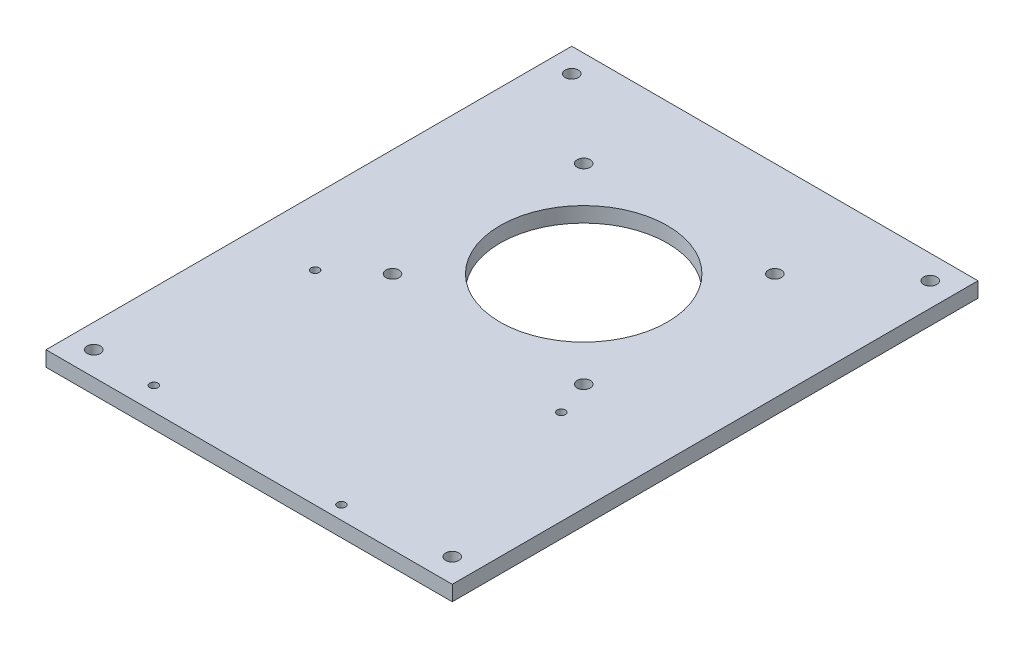
ISO-10303-21;
HEADER;
FILE_DESCRIPTION(('STEP AP214'),'2;1');
FILE_NAME('part.step','',(''),(''),'','','');
FILE_SCHEMA(('AUTOMOTIVE_DESIGN { 1 0 10303 214 1 1 1 1 }'));
ENDSEC;
DATA;
#1=APPLICATION_CONTEXT('core data for automotive mechanical design processes');
#2=APPLICATION_PROTOCOL_DEFINITION('international standard','automotive_design',2000,#1);
#3=PRODUCT_CONTEXT('',#1,'mechanical');
#4=PRODUCT('Part','Part','',(#3));
#5=PRODUCT_RELATED_PRODUCT_CATEGORY('part','',(#4));
#6=PRODUCT_DEFINITION_FORMATION('','',#4);
#7=PRODUCT_DEFINITION_CONTEXT('part definition',#1,'design');
#8=PRODUCT_DEFINITION('design','',#6,#7);
#9=PRODUCT_DEFINITION_SHAPE('','',#8);
#10=(LENGTH_UNIT() NAMED_UNIT(*) SI_UNIT(.MILLI.,.METRE.));
#11=(NAMED_UNIT(*) PLANE_ANGLE_UNIT() SI_UNIT($,.RADIAN.));
#12=(NAMED_UNIT(*) SI_UNIT($,.STERADIAN.) SOLID_ANGLE_UNIT());
#13=UNCERTAINTY_MEASURE_WITH_UNIT(LENGTH_MEASURE(1.E-05),#10,'distance_accuracy_value','');
#14=(GEOMETRIC_REPRESENTATION_CONTEXT(3) GLOBAL_UNCERTAINTY_ASSIGNED_CONTEXT((#13)) GLOBAL_UNIT_ASSIGNED_CONTEXT((#10,
#11,#12)) REPRESENTATION_CONTEXT('',''));
#15=CARTESIAN_POINT('',(0.,0.,0.));
#16=DIRECTION('',(0.,0.,1.));
#17=DIRECTION('',(1.,0.,0.));
#18=AXIS2_PLACEMENT_3D('',#15,#16,#17);
#19=CARTESIAN_POINT('',(0.,6.35,0.));
#20=DIRECTION('',(0.,1.,0.));
#21=DIRECTION('',(0.,0.,1.));
#22=AXIS2_PLACEMENT_3D('',#19,#20,#21);
#23=PLANE('',#22);
#24=CARTESIAN_POINT('',(-57.523089763629,6.34999999999999,54.859977456023));
#25=DIRECTION('',(0.,-1.,0.));
#26=DIRECTION('',(0.,0.,-1.));
#27=AXIS2_PLACEMENT_3D('',#24,#25,#26);
#28=CIRCLE('',#27,1.69999999999999);
#29=CARTESIAN_POINT('',(-57.523089763629,6.34999999999999,53.159977456023));
#30=VERTEX_POINT('',#29);
#31=EDGE_CURVE('E194',#30,#30,#28,.T.);
#32=ORIENTED_EDGE('',*,*,#31,.T.);
#33=EDGE_LOOP('',(#32));
#34=FACE_BOUND('',#33,.T.);
#35=CARTESIAN_POINT('',(45.476910236371,6.34999999999999,54.859977456023));
#36=DIRECTION('',(0.,-1.,0.));
#37=DIRECTION('',(0.,0.,-1.));
#38=AXIS2_PLACEMENT_3D('',#35,#36,#37);
#39=CIRCLE('',#38,1.69999999999999);
#40=CARTESIAN_POINT('',(45.476910236371,6.34999999999999,53.159977456023));
#41=VERTEX_POINT('',#40);
#42=EDGE_CURVE('E185',#41,#41,#39,.T.);
#43=ORIENTED_EDGE('',*,*,#42,.T.);
#44=EDGE_LOOP('',(#43));
#45=FACE_BOUND('',#44,.T.);
#46=CARTESIAN_POINT('',(32.976910236371,6.34999999999999,134.359977456023));
#47=DIRECTION('',(0.,-1.,0.));
#48=DIRECTION('',(0.,0.,-1.));
#49=AXIS2_PLACEMENT_3D('',#46,#47,#48);
#50=CIRCLE('',#49,1.69999999999999);
#51=CARTESIAN_POINT('',(32.976910236371,6.34999999999999,132.659977456023));
#52=VERTEX_POINT('',#51);
#53=EDGE_CURVE('E176',#52,#52,#50,.T.);
#54=ORIENTED_EDGE('',*,*,#53,.T.);
#55=EDGE_LOOP('',(#54));
#56=FACE_BOUND('',#55,.T.);
#57=CARTESIAN_POINT('',(-49.523089763629,6.34999999999999,130.359977456023));
#58=DIRECTION('',(0.,-1.,0.));
#59=DIRECTION('',(0.,0.,-1.));
#60=AXIS2_PLACEMENT_3D('',#57,#58,#59);
#61=CIRCLE('',#60,1.69999999999999);
#62=CARTESIAN_POINT('',(-49.523089763629,6.34999999999999,128.659977456023));
#63=VERTEX_POINT('',#62);
#64=EDGE_CURVE('E165',#63,#63,#61,.T.);
#65=ORIENTED_EDGE('',*,*,#64,.T.);
#66=EDGE_LOOP('',(#65));
#67=FACE_BOUND('',#66,.T.);
#68=CARTESIAN_POINT('',(75.,6.35,-70.));
#69=DIRECTION('',(0.,1.,0.));
#70=DIRECTION('',(0.,0.,-1.));
#71=AXIS2_PLACEMENT_3D('',#68,#69,#70);
#72=CIRCLE('',#71,2.75000000000001);
#73=CARTESIAN_POINT('',(75.,6.35,-72.75));
#74=VERTEX_POINT('',#73);
#75=EDGE_CURVE('E153',#74,#74,#72,.T.);
#76=ORIENTED_EDGE('',*,*,#75,.F.);
#77=EDGE_LOOP('',(#76));
#78=FACE_BOUND('',#77,.T.);
#79=CARTESIAN_POINT('',(-75.,6.35,-70.));
#80=DIRECTION('',(0.,1.,0.));
#81=DIRECTION('',(0.,0.,1.));
#82=AXIS2_PLACEMENT_3D('',#79,#80,#81);
#83=CIRCLE('',#82,2.75000000000001);
#84=CARTESIAN_POINT('',(-75.,6.35,-67.25));
#85=VERTEX_POINT('',#84);
#86=EDGE_CURVE('E141',#85,#85,#83,.T.);
#87=ORIENTED_EDGE('',*,*,#86,.F.);
#88=EDGE_LOOP('',(#87));
#89=FACE_BOUND('',#88,.T.);
#90=CARTESIAN_POINT('',(40.,6.35,40.));
#91=DIRECTION('',(0.,1.,0.));
#92=DIRECTION('',(0.,0.,1.));
#93=AXIS2_PLACEMENT_3D('',#90,#91,#92);
#94=CIRCLE('',#93,2.75000000000001);
#95=CARTESIAN_POINT('',(40.,6.35,42.75));
#96=VERTEX_POINT('',#95);
#97=EDGE_CURVE('E129',#96,#96,#94,.T.);
#98=ORIENTED_EDGE('',*,*,#97,.F.);
#99=EDGE_LOOP('',(#98));
#100=FACE_BOUND('',#99,.T.);
#101=CARTESIAN_POINT('',(-40.,6.35,-40.));
#102=DIRECTION('',(0.,1.,0.));
#103=DIRECTION('',(0.,0.,1.));
#104=AXIS2_PLACEMENT_3D('',#101,#102,#103);
#105=CIRCLE('',#104,2.75000000000001);
#106=CARTESIAN_POINT('',(-40.,6.35,-37.25));
#107=VERTEX_POINT('',#106);
#108=EDGE_CURVE('E117',#107,#107,#105,.T.);
#109=ORIENTED_EDGE('',*,*,#108,.F.);
#110=EDGE_LOOP('',(#109));
#111=FACE_BOUND('',#110,.T.);
#112=DIRECTION('',(0.,0.,1.));
#113=VECTOR('',#112,1.);
#114=CARTESIAN_POINT('',(-85.,6.35,-80.));
#115=LINE('',#114,#113);
#116=CARTESIAN_POINT('',(-85.,6.35,-80.));
#117=VERTEX_POINT('',#116);
#118=CARTESIAN_POINT('',(-85.,6.35,140.));
#119=VERTEX_POINT('',#118);
#120=EDGE_CURVE('E87',#117,#119,#115,.T.);
#121=ORIENTED_EDGE('',*,*,#120,.T.);
#122=DIRECTION('',(1.,0.,0.));
#123=VECTOR('',#122,1.);
#124=CARTESIAN_POINT('',(-85.,6.35,140.));
#125=LINE('',#124,#123);
#126=CARTESIAN_POINT('',(85.,6.35,140.));
#127=VERTEX_POINT('',#126);
#128=EDGE_CURVE('E82',#119,#127,#125,.T.);
#129=ORIENTED_EDGE('',*,*,#128,.T.);
#130=DIRECTION('',(0.,0.,-1.));
#131=VECTOR('',#130,1.);
#132=CARTESIAN_POINT('',(85.,6.35,-80.));
#133=LINE('',#132,#131);
#134=CARTESIAN_POINT('',(85.,6.35,-80.));
#135=VERTEX_POINT('',#134);
#136=EDGE_CURVE('E85',#127,#135,#133,.T.);
#137=ORIENTED_EDGE('',*,*,#136,.T.);
#138=DIRECTION('',(-1.,0.,0.));
#139=VECTOR('',#138,1.);
#140=CARTESIAN_POINT('',(-85.,6.35,-80.));
#141=LINE('',#140,#139);
#142=EDGE_CURVE('E52',#135,#117,#141,.T.);
#143=ORIENTED_EDGE('',*,*,#142,.T.);
#144=EDGE_LOOP('',(#121,#129,#137,#143));
#145=FACE_BOUND('',#144,.T.);
#146=CARTESIAN_POINT('',(0.,6.35,0.));
#147=DIRECTION('',(0.,1.,0.));
#148=DIRECTION('',(0.,0.,1.));
#149=AXIS2_PLACEMENT_3D('',#146,#147,#148);
#150=CIRCLE('',#149,35.);
#151=CARTESIAN_POINT('',(0.,6.35,35.));
#152=VERTEX_POINT('',#151);
#153=EDGE_CURVE('E102',#152,#152,#150,.T.);
#154=ORIENTED_EDGE('',*,*,#153,.F.);
#155=EDGE_LOOP('',(#154));
#156=FACE_BOUND('',#155,.T.);
#157=CARTESIAN_POINT('',(40.,6.35,-40.));
#158=DIRECTION('',(0.,1.,0.));
#159=DIRECTION('',(0.,0.,-1.));
#160=AXIS2_PLACEMENT_3D('',#157,#158,#159);
#161=CIRCLE('',#160,2.75000000000001);
#162=CARTESIAN_POINT('',(40.,6.35,-42.75));
#163=VERTEX_POINT('',#162);
#164=EDGE_CURVE('E123',#163,#163,#161,.T.);
#165=ORIENTED_EDGE('',*,*,#164,.F.);
#166=EDGE_LOOP('',(#165));
#167=FACE_BOUND('',#166,.T.);
#168=CARTESIAN_POINT('',(-40.,6.35,40.));
#169=DIRECTION('',(0.,1.,0.));
#170=DIRECTION('',(0.,0.,-1.));
#171=AXIS2_PLACEMENT_3D('',#168,#169,#170);
#172=CIRCLE('',#171,2.75000000000001);
#173=CARTESIAN_POINT('',(-40.,6.35,37.25));
#174=VERTEX_POINT('',#173);
#175=EDGE_CURVE('E135',#174,#174,#172,.T.);
#176=ORIENTED_EDGE('',*,*,#175,.F.);
#177=EDGE_LOOP('',(#176));
#178=FACE_BOUND('',#177,.T.);
#179=CARTESIAN_POINT('',(-75.,6.35,130.));
#180=DIRECTION('',(0.,1.,0.));
#181=DIRECTION('',(0.,0.,1.));
#182=AXIS2_PLACEMENT_3D('',#179,#180,#181);
#183=CIRCLE('',#182,2.75000000000001);
#184=CARTESIAN_POINT('',(-75.,6.35,132.75));
#185=VERTEX_POINT('',#184);
#186=EDGE_CURVE('E147',#185,#185,#183,.T.);
#187=ORIENTED_EDGE('',*,*,#186,.F.);
#188=EDGE_LOOP('',(#187));
#189=FACE_BOUND('',#188,.T.);
#190=CARTESIAN_POINT('',(75.0000000000001,6.35,130.));
#191=DIRECTION('',(0.,1.,0.));
#192=DIRECTION('',(0.,0.,-1.));
#193=AXIS2_PLACEMENT_3D('',#190,#191,#192);
#194=CIRCLE('',#193,2.75000000000001);
#195=CARTESIAN_POINT('',(75.0000000000001,6.35,127.25));
#196=VERTEX_POINT('',#195);
#197=EDGE_CURVE('E159',#196,#196,#194,.T.);
#198=ORIENTED_EDGE('',*,*,#197,.F.);
#199=EDGE_LOOP('',(#198));
#200=FACE_BOUND('',#199,.T.);
#201=ADVANCED_FACE('F35',(#34,#45,#56,#67,#78,#89,#100,#111,#145,#156,#167,#178,#189,#200),#23,.T.);
#202=CARTESIAN_POINT('',(0.,0.,0.));
#203=DIRECTION('',(0.,1.,0.));
#204=DIRECTION('',(0.,0.,1.));
#205=AXIS2_PLACEMENT_3D('',#202,#203,#204);
#206=PLANE('',#205);
#207=CARTESIAN_POINT('',(-57.523089763629,0.,54.859977456023));
#208=DIRECTION('',(0.,-1.,0.));
#209=DIRECTION('',(0.,0.,-1.));
#210=AXIS2_PLACEMENT_3D('',#207,#208,#209);
#211=CIRCLE('',#210,3.15);
#212=CARTESIAN_POINT('',(-57.523089763629,0.,51.709977456023));
#213=VERTEX_POINT('',#212);
#214=EDGE_CURVE('E200',#213,#213,#211,.T.);
#215=ORIENTED_EDGE('',*,*,#214,.F.);
#216=EDGE_LOOP('',(#215));
#217=FACE_BOUND('',#216,.T.);
#218=CARTESIAN_POINT('',(45.476910236371,0.,54.859977456023));
#219=DIRECTION('',(0.,-1.,0.));
#220=DIRECTION('',(0.,0.,-1.));
#221=AXIS2_PLACEMENT_3D('',#218,#219,#220);
#222=CIRCLE('',#221,3.15);
#223=CARTESIAN_POINT('',(45.476910236371,0.,51.709977456023));
#224=VERTEX_POINT('',#223);
#225=EDGE_CURVE('E191',#224,#224,#222,.T.);
#226=ORIENTED_EDGE('',*,*,#225,.F.);
#227=EDGE_LOOP('',(#226));
#228=FACE_BOUND('',#227,.T.);
#229=CARTESIAN_POINT('',(32.976910236371,0.,134.359977456023));
#230=DIRECTION('',(0.,-1.,0.));
#231=DIRECTION('',(0.,0.,-1.));
#232=AXIS2_PLACEMENT_3D('',#229,#230,#231);
#233=CIRCLE('',#232,3.15);
#234=CARTESIAN_POINT('',(32.976910236371,0.,131.209977456023));
#235=VERTEX_POINT('',#234);
#236=EDGE_CURVE('E182',#235,#235,#233,.T.);
#237=ORIENTED_EDGE('',*,*,#236,.F.);
#238=EDGE_LOOP('',(#237));
#239=FACE_BOUND('',#238,.T.);
#240=CARTESIAN_POINT('',(-49.523089763629,0.,130.359977456023));
#241=DIRECTION('',(0.,-1.,0.));
#242=DIRECTION('',(0.,0.,-1.));
#243=AXIS2_PLACEMENT_3D('',#240,#241,#242);
#244=CIRCLE('',#243,3.15);
#245=CARTESIAN_POINT('',(-49.523089763629,0.,127.209977456023));
#246=VERTEX_POINT('',#245);
#247=EDGE_CURVE('E173',#246,#246,#244,.T.);
#248=ORIENTED_EDGE('',*,*,#247,.F.);
#249=EDGE_LOOP('',(#248));
#250=FACE_BOUND('',#249,.T.);
#251=CARTESIAN_POINT('',(75.,0.,-70.));
#252=DIRECTION('',(0.,1.,0.));
#253=DIRECTION('',(0.,0.,-1.));
#254=AXIS2_PLACEMENT_3D('',#251,#252,#253);
#255=CIRCLE('',#254,2.75000000000001);
#256=CARTESIAN_POINT('',(75.,0.,-72.75));
#257=VERTEX_POINT('',#256);
#258=EDGE_CURVE('E156',#257,#257,#255,.T.);
#259=ORIENTED_EDGE('',*,*,#258,.T.);
#260=EDGE_LOOP('',(#259));
#261=FACE_BOUND('',#260,.T.);
#262=CARTESIAN_POINT('',(-75.,0.,-70.));
#263=DIRECTION('',(0.,1.,0.));
#264=DIRECTION('',(0.,0.,1.));
#265=AXIS2_PLACEMENT_3D('',#262,#263,#264);
#266=CIRCLE('',#265,2.75000000000001);
#267=CARTESIAN_POINT('',(-75.,0.,-67.25));
#268=VERTEX_POINT('',#267);
#269=EDGE_CURVE('E144',#268,#268,#266,.T.);
#270=ORIENTED_EDGE('',*,*,#269,.T.);
#271=EDGE_LOOP('',(#270));
#272=FACE_BOUND('',#271,.T.);
#273=CARTESIAN_POINT('',(40.,0.,40.));
#274=DIRECTION('',(0.,1.,0.));
#275=DIRECTION('',(0.,0.,1.));
#276=AXIS2_PLACEMENT_3D('',#273,#274,#275);
#277=CIRCLE('',#276,2.75000000000001);
#278=CARTESIAN_POINT('',(40.,0.,42.75));
#279=VERTEX_POINT('',#278);
#280=EDGE_CURVE('E132',#279,#279,#277,.T.);
#281=ORIENTED_EDGE('',*,*,#280,.T.);
#282=EDGE_LOOP('',(#281));
#283=FACE_BOUND('',#282,.T.);
#284=CARTESIAN_POINT('',(-40.,0.,-40.));
#285=DIRECTION('',(0.,1.,0.));
#286=DIRECTION('',(0.,0.,1.));
#287=AXIS2_PLACEMENT_3D('',#284,#285,#286);
#288=CIRCLE('',#287,2.75000000000001);
#289=CARTESIAN_POINT('',(-40.,0.,-37.25));
#290=VERTEX_POINT('',#289);
#291=EDGE_CURVE('E120',#290,#290,#288,.T.);
#292=ORIENTED_EDGE('',*,*,#291,.T.);
#293=EDGE_LOOP('',(#292));
#294=FACE_BOUND('',#293,.T.);
#295=DIRECTION('',(0.,0.,1.));
#296=VECTOR('',#295,1.);
#297=CARTESIAN_POINT('',(-85.,0.,-80.));
#298=LINE('',#297,#296);
#299=CARTESIAN_POINT('',(-85.,0.,-80.));
#300=VERTEX_POINT('',#299);
#301=CARTESIAN_POINT('',(-85.,0.,140.));
#302=VERTEX_POINT('',#301);
#303=EDGE_CURVE('E99',#300,#302,#298,.T.);
#304=ORIENTED_EDGE('',*,*,#303,.F.);
#305=DIRECTION('',(-1.,0.,0.));
#306=VECTOR('',#305,1.);
#307=CARTESIAN_POINT('',(-85.,0.,-80.));
#308=LINE('',#307,#306);
#309=CARTESIAN_POINT('',(85.,0.,-80.));
#310=VERTEX_POINT('',#309);
#311=EDGE_CURVE('E75',#310,#300,#308,.T.);
#312=ORIENTED_EDGE('',*,*,#311,.F.);
#313=DIRECTION('',(0.,0.,-1.));
#314=VECTOR('',#313,1.);
#315=CARTESIAN_POINT('',(85.,0.,-80.));
#316=LINE('',#315,#314);
#317=CARTESIAN_POINT('',(85.,0.,140.));
#318=VERTEX_POINT('',#317);
#319=EDGE_CURVE('E69',#318,#310,#316,.T.);
#320=ORIENTED_EDGE('',*,*,#319,.F.);
#321=DIRECTION('',(1.,0.,0.));
#322=VECTOR('',#321,1.);
#323=CARTESIAN_POINT('',(-85.,0.,140.));
#324=LINE('',#323,#322);
#325=EDGE_CURVE('E91',#302,#318,#324,.T.);
#326=ORIENTED_EDGE('',*,*,#325,.F.);
#327=EDGE_LOOP('',(#304,#312,#320,#326));
#328=FACE_BOUND('',#327,.T.);
#329=CARTESIAN_POINT('',(0.,0.,0.));
#330=DIRECTION('',(0.,1.,0.));
#331=DIRECTION('',(0.,0.,1.));
#332=AXIS2_PLACEMENT_3D('',#329,#330,#331);
#333=CIRCLE('',#332,35.);
#334=CARTESIAN_POINT('',(0.,0.,35.));
#335=VERTEX_POINT('',#334);
#336=EDGE_CURVE('E114',#335,#335,#333,.T.);
#337=ORIENTED_EDGE('',*,*,#336,.T.);
#338=EDGE_LOOP('',(#337));
#339=FACE_BOUND('',#338,.T.);
#340=CARTESIAN_POINT('',(40.,0.,-40.));
#341=DIRECTION('',(0.,1.,0.));
#342=DIRECTION('',(0.,0.,-1.));
#343=AXIS2_PLACEMENT_3D('',#340,#341,#342);
#344=CIRCLE('',#343,2.75000000000001);
#345=CARTESIAN_POINT('',(40.,0.,-42.75));
#346=VERTEX_POINT('',#345);
#347=EDGE_CURVE('E126',#346,#346,#344,.T.);
#348=ORIENTED_EDGE('',*,*,#347,.T.);
#349=EDGE_LOOP('',(#348));
#350=FACE_BOUND('',#349,.T.);
#351=CARTESIAN_POINT('',(-40.,0.,40.));
#352=DIRECTION('',(0.,1.,0.));
#353=DIRECTION('',(0.,0.,-1.));
#354=AXIS2_PLACEMENT_3D('',#351,#352,#353);
#355=CIRCLE('',#354,2.75000000000001);
#356=CARTESIAN_POINT('',(-40.,0.,37.25));
#357=VERTEX_POINT('',#356);
#358=EDGE_CURVE('E138',#357,#357,#355,.T.);
#359=ORIENTED_EDGE('',*,*,#358,.T.);
#360=EDGE_LOOP('',(#359));
#361=FACE_BOUND('',#360,.T.);
#362=CARTESIAN_POINT('',(-75.,0.,130.));
#363=DIRECTION('',(0.,1.,0.));
#364=DIRECTION('',(0.,0.,1.));
#365=AXIS2_PLACEMENT_3D('',#362,#363,#364);
#366=CIRCLE('',#365,2.75000000000001);
#367=CARTESIAN_POINT('',(-75.,0.,132.75));
#368=VERTEX_POINT('',#367);
#369=EDGE_CURVE('E150',#368,#368,#366,.T.);
#370=ORIENTED_EDGE('',*,*,#369,.T.);
#371=EDGE_LOOP('',(#370));
#372=FACE_BOUND('',#371,.T.);
#373=CARTESIAN_POINT('',(75.0000000000001,0.,130.));
#374=DIRECTION('',(0.,1.,0.));
#375=DIRECTION('',(0.,0.,-1.));
#376=AXIS2_PLACEMENT_3D('',#373,#374,#375);
#377=CIRCLE('',#376,2.75000000000001);
#378=CARTESIAN_POINT('',(75.0000000000001,0.,127.25));
#379=VERTEX_POINT('',#378);
#380=EDGE_CURVE('E162',#379,#379,#377,.T.);
#381=ORIENTED_EDGE('',*,*,#380,.T.);
#382=EDGE_LOOP('',(#381));
#383=FACE_BOUND('',#382,.T.);
#384=ADVANCED_FACE('F110',(#217,#228,#239,#250,#261,#272,#283,#294,#328,#339,#350,#361,#372,
#383),#206,.F.);
#385=CARTESIAN_POINT('',(-85.,6.35,-80.));
#386=DIRECTION('',(1.,0.,0.));
#387=DIRECTION('',(0.,0.,-1.));
#388=AXIS2_PLACEMENT_3D('',#385,#386,#387);
#389=PLANE('',#388);
#390=ORIENTED_EDGE('',*,*,#303,.T.);
#391=DIRECTION('',(0.,-1.,0.));
#392=VECTOR('',#391,1.);
#393=CARTESIAN_POINT('',(-85.,6.35,140.));
#394=LINE('',#393,#392);
#395=EDGE_CURVE('E11',#119,#302,#394,.T.);
#396=ORIENTED_EDGE('',*,*,#395,.F.);
#397=ORIENTED_EDGE('',*,*,#120,.F.);
#398=DIRECTION('',(0.,-1.,0.));
#399=VECTOR('',#398,1.);
#400=CARTESIAN_POINT('',(-85.,6.35,-80.));
#401=LINE('',#400,#399);
#402=EDGE_CURVE('E95',#117,#300,#401,.T.);
#403=ORIENTED_EDGE('',*,*,#402,.T.);
#404=EDGE_LOOP('',(#390,#396,#397,#403));
#405=FACE_BOUND('',#404,.T.);
#406=ADVANCED_FACE('F37',(#405),#389,.F.);
#407=CARTESIAN_POINT('',(-85.,6.35,140.));
#408=DIRECTION('',(0.,0.,-1.));
#409=DIRECTION('',(-1.,0.,0.));
#410=AXIS2_PLACEMENT_3D('',#407,#408,#409);
#411=PLANE('',#410);
#412=ORIENTED_EDGE('',*,*,#325,.T.);
#413=DIRECTION('',(0.,-1.,0.));
#414=VECTOR('',#413,1.);
#415=CARTESIAN_POINT('',(85.,6.35,140.));
#416=LINE('',#415,#414);
#417=EDGE_CURVE('E44',#127,#318,#416,.T.);
#418=ORIENTED_EDGE('',*,*,#417,.F.);
#419=ORIENTED_EDGE('',*,*,#128,.F.);
#420=ORIENTED_EDGE('',*,*,#395,.T.);
#421=EDGE_LOOP('',(#412,#418,#419,#420));
#422=FACE_BOUND('',#421,.T.);
#423=ADVANCED_FACE('F90',(#422),#411,.F.);
#424=CARTESIAN_POINT('',(85.,6.35,-80.));
#425=DIRECTION('',(-1.,0.,0.));
#426=DIRECTION('',(0.,0.,1.));
#427=AXIS2_PLACEMENT_3D('',#424,#425,#426);
#428=PLANE('',#427);
#429=ORIENTED_EDGE('',*,*,#319,.T.);
#430=DIRECTION('',(0.,-1.,0.));
#431=VECTOR('',#430,1.);
#432=CARTESIAN_POINT('',(85.,6.35,-80.));
#433=LINE('',#432,#431);
#434=EDGE_CURVE('E92',#135,#310,#433,.T.);
#435=ORIENTED_EDGE('',*,*,#434,.F.);
#436=ORIENTED_EDGE('',*,*,#136,.F.);
#437=ORIENTED_EDGE('',*,*,#417,.T.);
#438=EDGE_LOOP('',(#429,#435,#436,#437));
#439=FACE_BOUND('',#438,.T.);
#440=ADVANCED_FACE('F93',(#439),#428,.F.);
#441=CARTESIAN_POINT('',(-85.,6.35,-80.));
#442=DIRECTION('',(0.,0.,1.));
#443=DIRECTION('',(1.,0.,0.));
#444=AXIS2_PLACEMENT_3D('',#441,#442,#443);
#445=PLANE('',#444);
#446=ORIENTED_EDGE('',*,*,#311,.T.);
#447=ORIENTED_EDGE('',*,*,#402,.F.);
#448=ORIENTED_EDGE('',*,*,#142,.F.);
#449=ORIENTED_EDGE('',*,*,#434,.T.);
#450=EDGE_LOOP('',(#446,#447,#448,#449));
#451=FACE_BOUND('',#450,.T.);
#452=ADVANCED_FACE('F107',(#451),#445,.F.);
#453=CARTESIAN_POINT('',(0.,6.35,0.));
#454=DIRECTION('',(0.,-1.,0.));
#455=DIRECTION('',(0.,0.,-1.));
#456=AXIS2_PLACEMENT_3D('',#453,#454,#455);
#457=CYLINDRICAL_SURFACE('',#456,35.);
#458=ORIENTED_EDGE('',*,*,#153,.T.);
#459=EDGE_LOOP('',(#458));
#460=FACE_BOUND('',#459,.T.);
#461=ORIENTED_EDGE('',*,*,#336,.F.);
#462=EDGE_LOOP('',(#461));
#463=FACE_BOUND('',#462,.T.);
#464=ADVANCED_FACE('F226',(#460,#463),#457,.F.);
#465=CARTESIAN_POINT('',(-40.,6.35,-40.));
#466=DIRECTION('',(0.,-1.,0.));
#467=DIRECTION('',(0.,0.,-1.));
#468=AXIS2_PLACEMENT_3D('',#465,#466,#467);
#469=CYLINDRICAL_SURFACE('',#468,2.75000000000001);
#470=ORIENTED_EDGE('',*,*,#108,.T.);
#471=EDGE_LOOP('',(#470));
#472=FACE_BOUND('',#471,.T.);
#473=ORIENTED_EDGE('',*,*,#291,.F.);
#474=EDGE_LOOP('',(#473));
#475=FACE_BOUND('',#474,.T.);
#476=ADVANCED_FACE('F223',(#472,#475),#469,.F.);
#477=CARTESIAN_POINT('',(40.,6.35,-40.));
#478=DIRECTION('',(0.,-1.,0.));
#479=DIRECTION('',(0.,0.,-1.));
#480=AXIS2_PLACEMENT_3D('',#477,#478,#479);
#481=CYLINDRICAL_SURFACE('',#480,2.75000000000001);
#482=ORIENTED_EDGE('',*,*,#164,.T.);
#483=EDGE_LOOP('',(#482));
#484=FACE_BOUND('',#483,.T.);
#485=ORIENTED_EDGE('',*,*,#347,.F.);
#486=EDGE_LOOP('',(#485));
#487=FACE_BOUND('',#486,.T.);
#488=ADVANCED_FACE('F225',(#484,#487),#481,.F.);
#489=CARTESIAN_POINT('',(40.,6.35,40.));
#490=DIRECTION('',(0.,-1.,0.));
#491=DIRECTION('',(0.,0.,-1.));
#492=AXIS2_PLACEMENT_3D('',#489,#490,#491);
#493=CYLINDRICAL_SURFACE('',#492,2.75000000000001);
#494=ORIENTED_EDGE('',*,*,#97,.T.);
#495=EDGE_LOOP('',(#494));
#496=FACE_BOUND('',#495,.T.);
#497=ORIENTED_EDGE('',*,*,#280,.F.);
#498=EDGE_LOOP('',(#497));
#499=FACE_BOUND('',#498,.T.);
#500=ADVANCED_FACE('F233',(#496,#499),#493,.F.);
#501=CARTESIAN_POINT('',(-40.,6.35,40.));
#502=DIRECTION('',(0.,-1.,0.));
#503=DIRECTION('',(0.,0.,-1.));
#504=AXIS2_PLACEMENT_3D('',#501,#502,#503);
#505=CYLINDRICAL_SURFACE('',#504,2.75000000000001);
#506=ORIENTED_EDGE('',*,*,#175,.T.);
#507=EDGE_LOOP('',(#506));
#508=FACE_BOUND('',#507,.T.);
#509=ORIENTED_EDGE('',*,*,#358,.F.);
#510=EDGE_LOOP('',(#509));
#511=FACE_BOUND('',#510,.T.);
#512=ADVANCED_FACE('F362',(#508,#511),#505,.F.);
#513=CARTESIAN_POINT('',(-75.,6.35,-70.));
#514=DIRECTION('',(0.,-1.,0.));
#515=DIRECTION('',(0.,0.,-1.));
#516=AXIS2_PLACEMENT_3D('',#513,#514,#515);
#517=CYLINDRICAL_SURFACE('',#516,2.75000000000001);
#518=ORIENTED_EDGE('',*,*,#86,.T.);
#519=EDGE_LOOP('',(#518));
#520=FACE_BOUND('',#519,.T.);
#521=ORIENTED_EDGE('',*,*,#269,.F.);
#522=EDGE_LOOP('',(#521));
#523=FACE_BOUND('',#522,.T.);
#524=ADVANCED_FACE('F358',(#520,#523),#517,.F.);
#525=CARTESIAN_POINT('',(-75.,6.35,130.));
#526=DIRECTION('',(0.,-1.,0.));
#527=DIRECTION('',(0.,0.,-1.));
#528=AXIS2_PLACEMENT_3D('',#525,#526,#527);
#529=CYLINDRICAL_SURFACE('',#528,2.75000000000001);
#530=ORIENTED_EDGE('',*,*,#186,.T.);
#531=EDGE_LOOP('',(#530));
#532=FACE_BOUND('',#531,.T.);
#533=ORIENTED_EDGE('',*,*,#369,.F.);
#534=EDGE_LOOP('',(#533));
#535=FACE_BOUND('',#534,.T.);
#536=ADVANCED_FACE('F354',(#532,#535),#529,.F.);
#537=CARTESIAN_POINT('',(75.,6.35,-70.));
#538=DIRECTION('',(0.,-1.,0.));
#539=DIRECTION('',(0.,0.,-1.));
#540=AXIS2_PLACEMENT_3D('',#537,#538,#539);
#541=CYLINDRICAL_SURFACE('',#540,2.75000000000001);
#542=ORIENTED_EDGE('',*,*,#75,.T.);
#543=EDGE_LOOP('',(#542));
#544=FACE_BOUND('',#543,.T.);
#545=ORIENTED_EDGE('',*,*,#258,.F.);
#546=EDGE_LOOP('',(#545));
#547=FACE_BOUND('',#546,.T.);
#548=ADVANCED_FACE('F350',(#544,#547),#541,.F.);
#549=CARTESIAN_POINT('',(75.0000000000001,6.35,130.));
#550=DIRECTION('',(0.,-1.,0.));
#551=DIRECTION('',(0.,0.,-1.));
#552=AXIS2_PLACEMENT_3D('',#549,#550,#551);
#553=CYLINDRICAL_SURFACE('',#552,2.75000000000001);
#554=ORIENTED_EDGE('',*,*,#197,.T.);
#555=EDGE_LOOP('',(#554));
#556=FACE_BOUND('',#555,.T.);
#557=ORIENTED_EDGE('',*,*,#380,.F.);
#558=EDGE_LOOP('',(#557));
#559=FACE_BOUND('',#558,.T.);
#560=ADVANCED_FACE('F272',(#556,#559),#553,.F.);
#561=CARTESIAN_POINT('',(-49.523089763629,0.,130.359977456023));
#562=DIRECTION('',(0.,-1.,0.));
#563=DIRECTION('',(0.,0.,-1.));
#564=AXIS2_PLACEMENT_3D('',#561,#562,#563);
#565=CYLINDRICAL_SURFACE('',#564,1.69999999999999);
#566=ORIENTED_EDGE('',*,*,#64,.F.);
#567=EDGE_LOOP('',(#566));
#568=FACE_BOUND('',#567,.T.);
#569=CARTESIAN_POINT('',(-49.523089763629,1.45000000000001,130.359977456023));
#570=DIRECTION('',(0.,-1.,0.));
#571=DIRECTION('',(0.,0.,-1.));
#572=AXIS2_PLACEMENT_3D('',#569,#570,#571);
#573=CIRCLE('',#572,1.69999999999999);
#574=CARTESIAN_POINT('',(-49.523089763629,1.45000000000001,128.659977456023));
#575=VERTEX_POINT('',#574);
#576=EDGE_CURVE('E170',#575,#575,#573,.T.);
#577=ORIENTED_EDGE('',*,*,#576,.T.);
#578=EDGE_LOOP('',(#577));
#579=FACE_BOUND('',#578,.T.);
#580=ADVANCED_FACE('F266',(#568,#579),#565,.F.);
#581=CARTESIAN_POINT('',(-49.523089763629,0.,130.359977456023));
#582=DIRECTION('',(0.,-1.,0.));
#583=DIRECTION('',(0.,0.,-1.));
#584=AXIS2_PLACEMENT_3D('',#581,#582,#583);
#585=CONICAL_SURFACE('',#584,3.15,0.78539816339745);
#586=ORIENTED_EDGE('',*,*,#576,.F.);
#587=EDGE_LOOP('',(#586));
#588=FACE_BOUND('',#587,.T.);
#589=ORIENTED_EDGE('',*,*,#247,.T.);
#590=EDGE_LOOP('',(#589));
#591=FACE_BOUND('',#590,.T.);
#592=ADVANCED_FACE('F271',(#588,#591),#585,.F.);
#593=CARTESIAN_POINT('',(32.976910236371,0.,134.359977456023));
#594=DIRECTION('',(0.,-1.,0.));
#595=DIRECTION('',(0.,0.,-1.));
#596=AXIS2_PLACEMENT_3D('',#593,#594,#595);
#597=CYLINDRICAL_SURFACE('',#596,1.69999999999999);
#598=ORIENTED_EDGE('',*,*,#53,.F.);
#599=EDGE_LOOP('',(#598));
#600=FACE_BOUND('',#599,.T.);
#601=CARTESIAN_POINT('',(32.976910236371,1.45000000000001,134.359977456023));
#602=DIRECTION('',(0.,-1.,0.));
#603=DIRECTION('',(0.,0.,-1.));
#604=AXIS2_PLACEMENT_3D('',#601,#602,#603);
#605=CIRCLE('',#604,1.69999999999999);
#606=CARTESIAN_POINT('',(32.976910236371,1.45000000000001,132.659977456023));
#607=VERTEX_POINT('',#606);
#608=EDGE_CURVE('E179',#607,#607,#605,.T.);
#609=ORIENTED_EDGE('',*,*,#608,.T.);
#610=EDGE_LOOP('',(#609));
#611=FACE_BOUND('',#610,.T.);
#612=ADVANCED_FACE('F284',(#600,#611),#597,.F.);
#613=CARTESIAN_POINT('',(32.976910236371,0.,134.359977456023));
#614=DIRECTION('',(0.,-1.,0.));
#615=DIRECTION('',(0.,0.,-1.));
#616=AXIS2_PLACEMENT_3D('',#613,#614,#615);
#617=CONICAL_SURFACE('',#616,3.15,0.78539816339745);
#618=ORIENTED_EDGE('',*,*,#608,.F.);
#619=EDGE_LOOP('',(#618));
#620=FACE_BOUND('',#619,.T.);
#621=ORIENTED_EDGE('',*,*,#236,.T.);
#622=EDGE_LOOP('',(#621));
#623=FACE_BOUND('',#622,.T.);
#624=ADVANCED_FACE('F294',(#620,#623),#617,.F.);
#625=CARTESIAN_POINT('',(45.476910236371,0.,54.859977456023));
#626=DIRECTION('',(0.,-1.,0.));
#627=DIRECTION('',(0.,0.,-1.));
#628=AXIS2_PLACEMENT_3D('',#625,#626,#627);
#629=CYLINDRICAL_SURFACE('',#628,1.69999999999999);
#630=ORIENTED_EDGE('',*,*,#42,.F.);
#631=EDGE_LOOP('',(#630));
#632=FACE_BOUND('',#631,.T.);
#633=CARTESIAN_POINT('',(45.476910236371,1.45000000000001,54.859977456023));
#634=DIRECTION('',(0.,-1.,0.));
#635=DIRECTION('',(0.,0.,-1.));
#636=AXIS2_PLACEMENT_3D('',#633,#634,#635);
#637=CIRCLE('',#636,1.69999999999999);
#638=CARTESIAN_POINT('',(45.476910236371,1.45000000000001,53.159977456023));
#639=VERTEX_POINT('',#638);
#640=EDGE_CURVE('E188',#639,#639,#637,.T.);
#641=ORIENTED_EDGE('',*,*,#640,.T.);
#642=EDGE_LOOP('',(#641));
#643=FACE_BOUND('',#642,.T.);
#644=ADVANCED_FACE('F304',(#632,#643),#629,.F.);
#645=CARTESIAN_POINT('',(45.476910236371,0.,54.859977456023));
#646=DIRECTION('',(0.,-1.,0.));
#647=DIRECTION('',(0.,0.,-1.));
#648=AXIS2_PLACEMENT_3D('',#645,#646,#647);
#649=CONICAL_SURFACE('',#648,3.15,0.78539816339745);
#650=ORIENTED_EDGE('',*,*,#640,.F.);
#651=EDGE_LOOP('',(#650));
#652=FACE_BOUND('',#651,.T.);
#653=ORIENTED_EDGE('',*,*,#225,.T.);
#654=EDGE_LOOP('',(#653));
#655=FACE_BOUND('',#654,.T.);
#656=ADVANCED_FACE('F314',(#652,#655),#649,.F.);
#657=CARTESIAN_POINT('',(-57.523089763629,0.,54.859977456023));
#658=DIRECTION('',(0.,-1.,0.));
#659=DIRECTION('',(0.,0.,-1.));
#660=AXIS2_PLACEMENT_3D('',#657,#658,#659);
#661=CYLINDRICAL_SURFACE('',#660,1.69999999999999);
#662=ORIENTED_EDGE('',*,*,#31,.F.);
#663=EDGE_LOOP('',(#662));
#664=FACE_BOUND('',#663,.T.);
#665=CARTESIAN_POINT('',(-57.523089763629,1.45000000000001,54.859977456023));
#666=DIRECTION('',(0.,-1.,0.));
#667=DIRECTION('',(0.,0.,-1.));
#668=AXIS2_PLACEMENT_3D('',#665,#666,#667);
#669=CIRCLE('',#668,1.69999999999999);
#670=CARTESIAN_POINT('',(-57.523089763629,1.45000000000001,53.159977456023));
#671=VERTEX_POINT('',#670);
#672=EDGE_CURVE('E197',#671,#671,#669,.T.);
#673=ORIENTED_EDGE('',*,*,#672,.T.);
#674=EDGE_LOOP('',(#673));
#675=FACE_BOUND('',#674,.T.);
#676=ADVANCED_FACE('F324',(#664,#675),#661,.F.);
#677=CARTESIAN_POINT('',(-57.523089763629,0.,54.859977456023));
#678=DIRECTION('',(0.,-1.,0.));
#679=DIRECTION('',(0.,0.,-1.));
#680=AXIS2_PLACEMENT_3D('',#677,#678,#679);
#681=CONICAL_SURFACE('',#680,3.15,0.78539816339745);
#682=ORIENTED_EDGE('',*,*,#672,.F.);
#683=EDGE_LOOP('',(#682));
#684=FACE_BOUND('',#683,.T.);
#685=ORIENTED_EDGE('',*,*,#214,.T.);
#686=EDGE_LOOP('',(#685));
#687=FACE_BOUND('',#686,.T.);
#688=ADVANCED_FACE('F204',(#684,#687),#681,.F.);
#689=CLOSED_SHELL('',(#201,#384,#406,#423,#440,#452,#464,#476,#488,#500,#512,#524,#536,#548,
#560,#580,#592,#612,#624,#644,#656,#676,#688));
#690=MANIFOLD_SOLID_BREP('B2',#689);
#691=ADVANCED_BREP_SHAPE_REPRESENTATION('',(#18,#690),#14);
#692=SHAPE_DEFINITION_REPRESENTATION(#9,#691);
ENDSEC;
END-ISO-10303-21;
